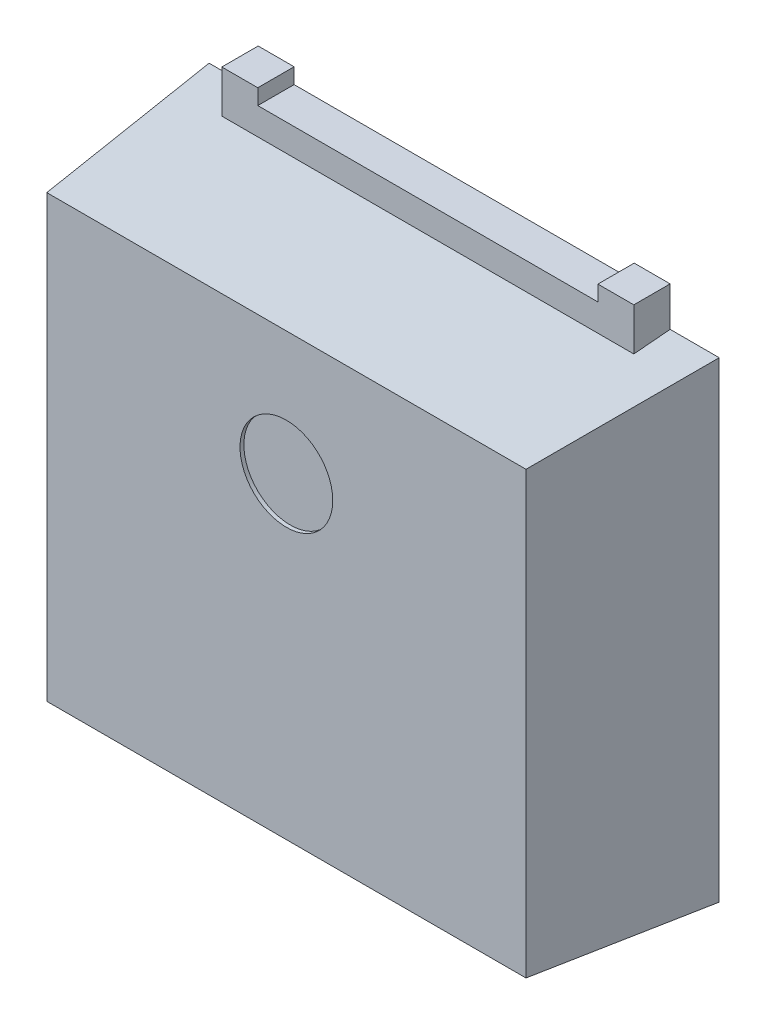
ISO-10303-21;
HEADER;
FILE_DESCRIPTION(('STEP AP214'),'2;1');
FILE_NAME('part.step','',(''),(''),'','','');
FILE_SCHEMA(('AUTOMOTIVE_DESIGN { 1 0 10303 214 1 1 1 1 }'));
ENDSEC;
DATA;
#1=APPLICATION_CONTEXT('core data for automotive mechanical design processes');
#2=APPLICATION_PROTOCOL_DEFINITION('international standard','automotive_design',2000,#1);
#3=PRODUCT_CONTEXT('',#1,'mechanical');
#4=PRODUCT('Part','Part','',(#3));
#5=PRODUCT_RELATED_PRODUCT_CATEGORY('part','',(#4));
#6=PRODUCT_DEFINITION_FORMATION('','',#4);
#7=PRODUCT_DEFINITION_CONTEXT('part definition',#1,'design');
#8=PRODUCT_DEFINITION('design','',#6,#7);
#9=PRODUCT_DEFINITION_SHAPE('','',#8);
#10=(LENGTH_UNIT() NAMED_UNIT(*) SI_UNIT(.MILLI.,.METRE.));
#11=(NAMED_UNIT(*) PLANE_ANGLE_UNIT() SI_UNIT($,.RADIAN.));
#12=(NAMED_UNIT(*) SI_UNIT($,.STERADIAN.) SOLID_ANGLE_UNIT());
#13=UNCERTAINTY_MEASURE_WITH_UNIT(LENGTH_MEASURE(1.E-05),#10,'distance_accuracy_value','');
#14=(GEOMETRIC_REPRESENTATION_CONTEXT(3) GLOBAL_UNCERTAINTY_ASSIGNED_CONTEXT((#13)) GLOBAL_UNIT_ASSIGNED_CONTEXT((#10,
#11,#12)) REPRESENTATION_CONTEXT('',''));
#15=CARTESIAN_POINT('',(0.,0.,0.));
#16=DIRECTION('',(0.,0.,1.));
#17=DIRECTION('',(1.,0.,0.));
#18=AXIS2_PLACEMENT_3D('',#15,#16,#17);
#19=CARTESIAN_POINT('',(0.,0.,0.));
#20=DIRECTION('',(0.,0.,1.));
#21=DIRECTION('',(1.,0.,0.));
#22=AXIS2_PLACEMENT_3D('',#19,#20,#21);
#23=PLANE('',#22);
#24=DIRECTION('',(-1.,0.,0.));
#25=VECTOR('',#24,1.);
#26=CARTESIAN_POINT('',(2.2,3.36,0.));
#27=LINE('',#26,#25);
#28=CARTESIAN_POINT('',(2.2,3.36,0.));
#29=VERTEX_POINT('',#28);
#30=CARTESIAN_POINT('',(-2.2,3.36,0.));
#31=VERTEX_POINT('',#30);
#32=EDGE_CURVE('P0_E153',#29,#31,#27,.T.);
#33=ORIENTED_EDGE('',*,*,#32,.F.);
#34=DIRECTION('',(0.,-1.,0.));
#35=VECTOR('',#34,1.);
#36=CARTESIAN_POINT('',(2.2,3.56,0.));
#37=LINE('',#36,#35);
#38=CARTESIAN_POINT('',(2.2,3.56,0.));
#39=VERTEX_POINT('',#38);
#40=EDGE_CURVE('P0_E26',#39,#29,#37,.T.);
#41=ORIENTED_EDGE('',*,*,#40,.F.);
#42=DIRECTION('',(1.,0.,0.));
#43=VECTOR('',#42,1.);
#44=CARTESIAN_POINT('',(2.2,3.56,0.));
#45=LINE('',#44,#43);
#46=CARTESIAN_POINT('',(2.665,3.56,0.));
#47=VERTEX_POINT('',#46);
#48=EDGE_CURVE('P0_E118',#39,#47,#45,.T.);
#49=ORIENTED_EDGE('',*,*,#48,.T.);
#50=DIRECTION('',(0.,-1.,0.));
#51=VECTOR('',#50,1.);
#52=CARTESIAN_POINT('',(2.665,3.56,0.));
#53=LINE('',#52,#51);
#54=CARTESIAN_POINT('',(2.665,2.698367694,0.));
#55=VERTEX_POINT('',#54);
#56=EDGE_CURVE('P0_E121',#47,#55,#53,.T.);
#57=ORIENTED_EDGE('',*,*,#56,.T.);
#58=DIRECTION('',(-1.,0.,0.));
#59=VECTOR('',#58,1.);
#60=CARTESIAN_POINT('',(2.665,2.698367694,0.));
#61=LINE('',#60,#59);
#62=CARTESIAN_POINT('',(2.177438699,2.698367694,0.));
#63=VERTEX_POINT('',#62);
#64=EDGE_CURVE('P0_E206',#55,#63,#61,.T.);
#65=ORIENTED_EDGE('',*,*,#64,.T.);
#66=DIRECTION('',(0.,-1.,0.));
#67=VECTOR('',#66,1.);
#68=CARTESIAN_POINT('',(2.177438699,2.698367694,0.));
#69=LINE('',#68,#67);
#70=CARTESIAN_POINT('',(2.177438699,2.012696816,0.));
#71=VERTEX_POINT('',#70);
#72=EDGE_CURVE('P0_E258',#63,#71,#69,.T.);
#73=ORIENTED_EDGE('',*,*,#72,.T.);
#74=DIRECTION('',(1.,0.,0.));
#75=VECTOR('',#74,1.);
#76=CARTESIAN_POINT('',(2.177438699,2.012696816,0.));
#77=LINE('',#76,#75);
#78=CARTESIAN_POINT('',(2.665,2.012696816,0.));
#79=VERTEX_POINT('',#78);
#80=EDGE_CURVE('P0_E268',#71,#79,#77,.T.);
#81=ORIENTED_EDGE('',*,*,#80,.T.);
#82=DIRECTION('',(0.,-1.,0.));
#83=VECTOR('',#82,1.);
#84=CARTESIAN_POINT('',(2.665,2.012696816,0.));
#85=LINE('',#84,#83);
#86=CARTESIAN_POINT('',(2.665,-1.84,0.));
#87=VERTEX_POINT('',#86);
#88=EDGE_CURVE('P0_E280',#79,#87,#85,.T.);
#89=ORIENTED_EDGE('',*,*,#88,.T.);
#90=DIRECTION('',(1.,0.,0.));
#91=VECTOR('',#90,1.);
#92=CARTESIAN_POINT('',(-2.665,-1.84,0.));
#93=LINE('',#92,#91);
#94=CARTESIAN_POINT('',(-2.665,-1.84,0.));
#95=VERTEX_POINT('',#94);
#96=EDGE_CURVE('P0_E262',#95,#87,#93,.T.);
#97=ORIENTED_EDGE('',*,*,#96,.F.);
#98=DIRECTION('',(0.,-1.,0.));
#99=VECTOR('',#98,1.);
#100=CARTESIAN_POINT('',(-2.665,2.012696816,0.));
#101=LINE('',#100,#99);
#102=CARTESIAN_POINT('',(-2.665,2.012696816,0.));
#103=VERTEX_POINT('',#102);
#104=EDGE_CURVE('P0_E246',#103,#95,#101,.T.);
#105=ORIENTED_EDGE('',*,*,#104,.F.);
#106=DIRECTION('',(-1.,0.,0.));
#107=VECTOR('',#106,1.);
#108=CARTESIAN_POINT('',(-2.177438699,2.012696816,0.));
#109=LINE('',#108,#107);
#110=CARTESIAN_POINT('',(-2.177438699,2.012696816,0.));
#111=VERTEX_POINT('',#110);
#112=EDGE_CURVE('P0_E234',#111,#103,#109,.T.);
#113=ORIENTED_EDGE('',*,*,#112,.F.);
#114=DIRECTION('',(0.,-1.,0.));
#115=VECTOR('',#114,1.);
#116=CARTESIAN_POINT('',(-2.177438699,2.698367694,0.));
#117=LINE('',#116,#115);
#118=CARTESIAN_POINT('',(-2.177438699,2.698367694,0.));
#119=VERTEX_POINT('',#118);
#120=EDGE_CURVE('P0_E181',#119,#111,#117,.T.);
#121=ORIENTED_EDGE('',*,*,#120,.F.);
#122=DIRECTION('',(1.,0.,0.));
#123=VECTOR('',#122,1.);
#124=CARTESIAN_POINT('',(-2.665,2.698367694,0.));
#125=LINE('',#124,#123);
#126=CARTESIAN_POINT('',(-2.665,2.698367694,0.));
#127=VERTEX_POINT('',#126);
#128=EDGE_CURVE('P0_E173',#127,#119,#125,.T.);
#129=ORIENTED_EDGE('',*,*,#128,.F.);
#130=DIRECTION('',(0.,-1.,0.));
#131=VECTOR('',#130,1.);
#132=CARTESIAN_POINT('',(-2.665,3.56,0.));
#133=LINE('',#132,#131);
#134=CARTESIAN_POINT('',(-2.665,3.56,0.));
#135=VERTEX_POINT('',#134);
#136=EDGE_CURVE('P0_E213',#135,#127,#133,.T.);
#137=ORIENTED_EDGE('',*,*,#136,.F.);
#138=DIRECTION('',(1.,0.,0.));
#139=VECTOR('',#138,1.);
#140=CARTESIAN_POINT('',(-2.665,3.56,0.));
#141=LINE('',#140,#139);
#142=CARTESIAN_POINT('',(-2.2,3.56,0.));
#143=VERTEX_POINT('',#142);
#144=EDGE_CURVE('P0_E199',#135,#143,#141,.T.);
#145=ORIENTED_EDGE('',*,*,#144,.T.);
#146=DIRECTION('',(0.,1.,0.));
#147=VECTOR('',#146,1.);
#148=CARTESIAN_POINT('',(-2.2,3.36,0.));
#149=LINE('',#148,#147);
#150=EDGE_CURVE('P0_E156',#31,#143,#149,.T.);
#151=ORIENTED_EDGE('',*,*,#150,.F.);
#152=EDGE_LOOP('',(#33,#41,#49,#57,#65,#73,#81,#89,#97,#105,#113,#121,#129,#137,#145,#151));
#153=FACE_BOUND('',#152,.T.);
#154=ADVANCED_FACE('P0_F17',(#153),#23,.F.);
#155=CARTESIAN_POINT('',(0.,0.,0.47));
#156=DIRECTION('',(0.,0.,1.));
#157=DIRECTION('',(1.,0.,0.));
#158=AXIS2_PLACEMENT_3D('',#155,#156,#157);
#159=PLANE('',#158);
#160=DIRECTION('',(-1.,0.,0.));
#161=VECTOR('',#160,1.);
#162=CARTESIAN_POINT('',(2.2,3.36,0.47));
#163=LINE('',#162,#161);
#164=CARTESIAN_POINT('',(2.2,3.36,0.47));
#165=VERTEX_POINT('',#164);
#166=CARTESIAN_POINT('',(-2.2,3.36,0.47));
#167=VERTEX_POINT('',#166);
#168=EDGE_CURVE('P0_E154',#165,#167,#163,.T.);
#169=ORIENTED_EDGE('',*,*,#168,.T.);
#170=DIRECTION('',(0.,1.,0.));
#171=VECTOR('',#170,1.);
#172=CARTESIAN_POINT('',(-2.2,3.36,0.47));
#173=LINE('',#172,#171);
#174=CARTESIAN_POINT('',(-2.2,3.56,0.47));
#175=VERTEX_POINT('',#174);
#176=EDGE_CURVE('P0_E188',#167,#175,#173,.T.);
#177=ORIENTED_EDGE('',*,*,#176,.T.);
#178=DIRECTION('',(1.,0.,0.));
#179=VECTOR('',#178,1.);
#180=CARTESIAN_POINT('',(-2.665,3.56,0.47));
#181=LINE('',#180,#179);
#182=CARTESIAN_POINT('',(-2.665,3.56,0.47));
#183=VERTEX_POINT('',#182);
#184=EDGE_CURVE('P0_E198',#183,#175,#181,.T.);
#185=ORIENTED_EDGE('',*,*,#184,.F.);
#186=DIRECTION('',(0.,-1.,0.));
#187=VECTOR('',#186,1.);
#188=CARTESIAN_POINT('',(-2.665,3.56,0.47));
#189=LINE('',#188,#187);
#190=CARTESIAN_POINT('',(-2.665,2.698367694,0.47));
#191=VERTEX_POINT('',#190);
#192=EDGE_CURVE('P0_E170',#183,#191,#189,.T.);
#193=ORIENTED_EDGE('',*,*,#192,.T.);
#194=DIRECTION('',(1.,0.,0.));
#195=VECTOR('',#194,1.);
#196=CARTESIAN_POINT('',(-2.665,2.698367694,0.47));
#197=LINE('',#196,#195);
#198=CARTESIAN_POINT('',(-2.177438699,2.698367694,0.47));
#199=VERTEX_POINT('',#198);
#200=EDGE_CURVE('P0_E178',#191,#199,#197,.T.);
#201=ORIENTED_EDGE('',*,*,#200,.T.);
#202=DIRECTION('',(0.,-1.,0.));
#203=VECTOR('',#202,1.);
#204=CARTESIAN_POINT('',(-2.177438699,2.698367694,0.47));
#205=LINE('',#204,#203);
#206=CARTESIAN_POINT('',(-2.177438699,2.012696816,0.47));
#207=VERTEX_POINT('',#206);
#208=EDGE_CURVE('P0_E230',#199,#207,#205,.T.);
#209=ORIENTED_EDGE('',*,*,#208,.T.);
#210=DIRECTION('',(-1.,0.,0.));
#211=VECTOR('',#210,1.);
#212=CARTESIAN_POINT('',(-2.177438699,2.012696816,0.47));
#213=LINE('',#212,#211);
#214=CARTESIAN_POINT('',(-2.665,2.012696816,0.47));
#215=VERTEX_POINT('',#214);
#216=EDGE_CURVE('P0_E242',#207,#215,#213,.T.);
#217=ORIENTED_EDGE('',*,*,#216,.T.);
#218=DIRECTION('',(0.,-1.,0.));
#219=VECTOR('',#218,1.);
#220=CARTESIAN_POINT('',(-2.665,2.012696816,0.47));
#221=LINE('',#220,#219);
#222=CARTESIAN_POINT('',(-2.665,-1.84,0.47));
#223=VERTEX_POINT('',#222);
#224=EDGE_CURVE('P0_E254',#215,#223,#221,.T.);
#225=ORIENTED_EDGE('',*,*,#224,.T.);
#226=DIRECTION('',(1.,0.,0.));
#227=VECTOR('',#226,1.);
#228=CARTESIAN_POINT('',(-2.665,-1.84,0.47));
#229=LINE('',#228,#227);
#230=CARTESIAN_POINT('',(2.665,-1.84,0.47));
#231=VERTEX_POINT('',#230);
#232=EDGE_CURVE('P0_E276',#223,#231,#229,.T.);
#233=ORIENTED_EDGE('',*,*,#232,.T.);
#234=DIRECTION('',(0.,-1.,0.));
#235=VECTOR('',#234,1.);
#236=CARTESIAN_POINT('',(2.665,2.012696816,0.47));
#237=LINE('',#236,#235);
#238=CARTESIAN_POINT('',(2.665,2.012696816,0.47));
#239=VERTEX_POINT('',#238);
#240=EDGE_CURVE('P0_E287',#239,#231,#237,.T.);
#241=ORIENTED_EDGE('',*,*,#240,.F.);
#242=DIRECTION('',(1.,0.,0.));
#243=VECTOR('',#242,1.);
#244=CARTESIAN_POINT('',(2.177438699,2.012696816,0.47));
#245=LINE('',#244,#243);
#246=CARTESIAN_POINT('',(2.177438699,2.012696816,0.47));
#247=VERTEX_POINT('',#246);
#248=EDGE_CURVE('P0_E267',#247,#239,#245,.T.);
#249=ORIENTED_EDGE('',*,*,#248,.F.);
#250=DIRECTION('',(0.,-1.,0.));
#251=VECTOR('',#250,1.);
#252=CARTESIAN_POINT('',(2.177438699,2.698367694,0.47));
#253=LINE('',#252,#251);
#254=CARTESIAN_POINT('',(2.177438699,2.698367694,0.47));
#255=VERTEX_POINT('',#254);
#256=EDGE_CURVE('P0_E203',#255,#247,#253,.T.);
#257=ORIENTED_EDGE('',*,*,#256,.F.);
#258=DIRECTION('',(-1.,0.,0.));
#259=VECTOR('',#258,1.);
#260=CARTESIAN_POINT('',(2.665,2.698367694,0.47));
#261=LINE('',#260,#259);
#262=CARTESIAN_POINT('',(2.665,2.698367694,0.47));
#263=VERTEX_POINT('',#262);
#264=EDGE_CURVE('P0_E113',#263,#255,#261,.T.);
#265=ORIENTED_EDGE('',*,*,#264,.F.);
#266=DIRECTION('',(0.,-1.,0.));
#267=VECTOR('',#266,1.);
#268=CARTESIAN_POINT('',(2.665,3.56,0.47));
#269=LINE('',#268,#267);
#270=CARTESIAN_POINT('',(2.665,3.56,0.47));
#271=VERTEX_POINT('',#270);
#272=EDGE_CURVE('P0_E109',#271,#263,#269,.T.);
#273=ORIENTED_EDGE('',*,*,#272,.F.);
#274=DIRECTION('',(1.,0.,0.));
#275=VECTOR('',#274,1.);
#276=CARTESIAN_POINT('',(2.2,3.56,0.47));
#277=LINE('',#276,#275);
#278=CARTESIAN_POINT('',(2.2,3.56,0.47));
#279=VERTEX_POINT('',#278);
#280=EDGE_CURVE('P0_E97',#279,#271,#277,.T.);
#281=ORIENTED_EDGE('',*,*,#280,.F.);
#282=DIRECTION('',(0.,-1.,0.));
#283=VECTOR('',#282,1.);
#284=CARTESIAN_POINT('',(2.2,3.56,0.47));
#285=LINE('',#284,#283);
#286=EDGE_CURVE('P0_E11',#279,#165,#285,.T.);
#287=ORIENTED_EDGE('',*,*,#286,.T.);
#288=EDGE_LOOP('',(#169,#177,#185,#193,#201,#209,#217,#225,#233,#241,#249,#257,#265,#273,#281,#287));
#289=FACE_BOUND('',#288,.T.);
#290=ADVANCED_FACE('P0_F111',(#289),#159,.T.);
#291=CARTESIAN_POINT('',(2.2,3.56,0.47));
#292=DIRECTION('',(1.,0.,0.));
#293=DIRECTION('',(0.,1.,0.));
#294=AXIS2_PLACEMENT_3D('',#291,#292,#293);
#295=PLANE('',#294);
#296=ORIENTED_EDGE('',*,*,#40,.T.);
#297=DIRECTION('',(0.,0.,-1.));
#298=VECTOR('',#297,1.);
#299=CARTESIAN_POINT('',(2.2,3.36,0.47));
#300=LINE('',#299,#298);
#301=EDGE_CURVE('P0_E142',#165,#29,#300,.T.);
#302=ORIENTED_EDGE('',*,*,#301,.F.);
#303=ORIENTED_EDGE('',*,*,#286,.F.);
#304=DIRECTION('',(0.,0.,-1.));
#305=VECTOR('',#304,1.);
#306=CARTESIAN_POINT('',(2.2,3.56,0.47));
#307=LINE('',#306,#305);
#308=EDGE_CURVE('P0_E104',#279,#39,#307,.T.);
#309=ORIENTED_EDGE('',*,*,#308,.T.);
#310=EDGE_LOOP('',(#296,#302,#303,#309));
#311=FACE_BOUND('',#310,.T.);
#312=ADVANCED_FACE('P0_F140',(#311),#295,.F.);
#313=CARTESIAN_POINT('',(2.4325,3.56,0.47));
#314=DIRECTION('',(0.,1.,0.));
#315=DIRECTION('',(1.,0.,0.));
#316=AXIS2_PLACEMENT_3D('',#313,#314,#315);
#317=PLANE('',#316);
#318=ORIENTED_EDGE('',*,*,#48,.F.);
#319=ORIENTED_EDGE('',*,*,#308,.F.);
#320=ORIENTED_EDGE('',*,*,#280,.T.);
#321=DIRECTION('',(0.,0.,-1.));
#322=VECTOR('',#321,1.);
#323=CARTESIAN_POINT('',(2.665,3.56,0.47));
#324=LINE('',#323,#322);
#325=EDGE_CURVE('P0_E102',#271,#47,#324,.T.);
#326=ORIENTED_EDGE('',*,*,#325,.T.);
#327=EDGE_LOOP('',(#318,#319,#320,#326));
#328=FACE_BOUND('',#327,.T.);
#329=ADVANCED_FACE('P0_F100',(#328),#317,.T.);
#330=CARTESIAN_POINT('',(2.665,3.05,0.47));
#331=DIRECTION('',(1.,0.,0.));
#332=DIRECTION('',(0.,1.,0.));
#333=AXIS2_PLACEMENT_3D('',#330,#331,#332);
#334=PLANE('',#333);
#335=ORIENTED_EDGE('',*,*,#56,.F.);
#336=ORIENTED_EDGE('',*,*,#325,.F.);
#337=ORIENTED_EDGE('',*,*,#272,.T.);
#338=DIRECTION('',(0.,0.,-1.));
#339=VECTOR('',#338,1.);
#340=CARTESIAN_POINT('',(2.665,2.698367694,0.47));
#341=LINE('',#340,#339);
#342=EDGE_CURVE('P0_E288',#263,#55,#341,.T.);
#343=ORIENTED_EDGE('',*,*,#342,.T.);
#344=EDGE_LOOP('',(#335,#336,#337,#343));
#345=FACE_BOUND('',#344,.T.);
#346=ADVANCED_FACE('P0_F120',(#345),#334,.T.);
#347=CARTESIAN_POINT('',(2.421219349,2.698367694,0.47));
#348=DIRECTION('',(0.,-1.,0.));
#349=DIRECTION('',(0.,0.,-1.));
#350=AXIS2_PLACEMENT_3D('',#347,#348,#349);
#351=PLANE('',#350);
#352=ORIENTED_EDGE('',*,*,#64,.F.);
#353=ORIENTED_EDGE('',*,*,#342,.F.);
#354=ORIENTED_EDGE('',*,*,#264,.T.);
#355=DIRECTION('',(0.,0.,-1.));
#356=VECTOR('',#355,1.);
#357=CARTESIAN_POINT('',(2.177438699,2.698367694,0.47));
#358=LINE('',#357,#356);
#359=EDGE_CURVE('P0_E207',#255,#63,#358,.T.);
#360=ORIENTED_EDGE('',*,*,#359,.T.);
#361=EDGE_LOOP('',(#352,#353,#354,#360));
#362=FACE_BOUND('',#361,.T.);
#363=ADVANCED_FACE('P0_F305',(#362),#351,.T.);
#364=CARTESIAN_POINT('',(2.177438699,2.355532255,0.47));
#365=DIRECTION('',(1.,0.,0.));
#366=DIRECTION('',(0.,1.,0.));
#367=AXIS2_PLACEMENT_3D('',#364,#365,#366);
#368=PLANE('',#367);
#369=ORIENTED_EDGE('',*,*,#72,.F.);
#370=ORIENTED_EDGE('',*,*,#359,.F.);
#371=ORIENTED_EDGE('',*,*,#256,.T.);
#372=DIRECTION('',(0.,0.,-1.));
#373=VECTOR('',#372,1.);
#374=CARTESIAN_POINT('',(2.177438699,2.012696816,0.47));
#375=LINE('',#374,#373);
#376=EDGE_CURVE('P0_E263',#247,#71,#375,.T.);
#377=ORIENTED_EDGE('',*,*,#376,.T.);
#378=EDGE_LOOP('',(#369,#370,#371,#377));
#379=FACE_BOUND('',#378,.T.);
#380=ADVANCED_FACE('P0_F312',(#379),#368,.T.);
#381=CARTESIAN_POINT('',(2.421219349,2.012696816,0.47));
#382=DIRECTION('',(0.,1.,0.));
#383=DIRECTION('',(1.,0.,0.));
#384=AXIS2_PLACEMENT_3D('',#381,#382,#383);
#385=PLANE('',#384);
#386=ORIENTED_EDGE('',*,*,#80,.F.);
#387=ORIENTED_EDGE('',*,*,#376,.F.);
#388=ORIENTED_EDGE('',*,*,#248,.T.);
#389=DIRECTION('',(0.,0.,-1.));
#390=VECTOR('',#389,1.);
#391=CARTESIAN_POINT('',(2.665,2.012696816,0.47));
#392=LINE('',#391,#390);
#393=EDGE_CURVE('P0_E283',#239,#79,#392,.T.);
#394=ORIENTED_EDGE('',*,*,#393,.T.);
#395=EDGE_LOOP('',(#386,#387,#388,#394));
#396=FACE_BOUND('',#395,.T.);
#397=ADVANCED_FACE('P0_F318',(#396),#385,.T.);
#398=CARTESIAN_POINT('',(2.665,0.86,0.47));
#399=DIRECTION('',(1.,0.,0.));
#400=DIRECTION('',(0.,1.,0.));
#401=AXIS2_PLACEMENT_3D('',#398,#399,#400);
#402=PLANE('',#401);
#403=ORIENTED_EDGE('',*,*,#88,.F.);
#404=ORIENTED_EDGE('',*,*,#393,.F.);
#405=ORIENTED_EDGE('',*,*,#240,.T.);
#406=DIRECTION('',(0.,0.,-1.));
#407=VECTOR('',#406,1.);
#408=CARTESIAN_POINT('',(2.665,-1.84,0.47));
#409=LINE('',#408,#407);
#410=EDGE_CURVE('P0_E272',#231,#87,#409,.T.);
#411=ORIENTED_EDGE('',*,*,#410,.T.);
#412=EDGE_LOOP('',(#403,#404,#405,#411));
#413=FACE_BOUND('',#412,.T.);
#414=ADVANCED_FACE('P0_F320',(#413),#402,.T.);
#415=CARTESIAN_POINT('',(0.,-1.84,0.47));
#416=DIRECTION('',(0.,1.,0.));
#417=DIRECTION('',(1.,0.,0.));
#418=AXIS2_PLACEMENT_3D('',#415,#416,#417);
#419=PLANE('',#418);
#420=ORIENTED_EDGE('',*,*,#96,.T.);
#421=ORIENTED_EDGE('',*,*,#410,.F.);
#422=ORIENTED_EDGE('',*,*,#232,.F.);
#423=DIRECTION('',(0.,0.,-1.));
#424=VECTOR('',#423,1.);
#425=CARTESIAN_POINT('',(-2.665,-1.84,0.47));
#426=LINE('',#425,#424);
#427=EDGE_CURVE('P0_E250',#223,#95,#426,.T.);
#428=ORIENTED_EDGE('',*,*,#427,.T.);
#429=EDGE_LOOP('',(#420,#421,#422,#428));
#430=FACE_BOUND('',#429,.T.);
#431=ADVANCED_FACE('P0_F323',(#430),#419,.F.);
#432=CARTESIAN_POINT('',(-2.665,0.086348408,0.47));
#433=DIRECTION('',(1.,0.,0.));
#434=DIRECTION('',(0.,1.,0.));
#435=AXIS2_PLACEMENT_3D('',#432,#433,#434);
#436=PLANE('',#435);
#437=ORIENTED_EDGE('',*,*,#104,.T.);
#438=ORIENTED_EDGE('',*,*,#427,.F.);
#439=ORIENTED_EDGE('',*,*,#224,.F.);
#440=DIRECTION('',(0.,0.,-1.));
#441=VECTOR('',#440,1.);
#442=CARTESIAN_POINT('',(-2.665,2.012696816,0.47));
#443=LINE('',#442,#441);
#444=EDGE_CURVE('P0_E238',#215,#103,#443,.T.);
#445=ORIENTED_EDGE('',*,*,#444,.T.);
#446=EDGE_LOOP('',(#437,#438,#439,#445));
#447=FACE_BOUND('',#446,.T.);
#448=ADVANCED_FACE('P0_F469',(#447),#436,.F.);
#449=CARTESIAN_POINT('',(-2.421219349,2.012696816,0.47));
#450=DIRECTION('',(0.,-1.,0.));
#451=DIRECTION('',(0.,0.,-1.));
#452=AXIS2_PLACEMENT_3D('',#449,#450,#451);
#453=PLANE('',#452);
#454=ORIENTED_EDGE('',*,*,#112,.T.);
#455=ORIENTED_EDGE('',*,*,#444,.F.);
#456=ORIENTED_EDGE('',*,*,#216,.F.);
#457=DIRECTION('',(0.,0.,-1.));
#458=VECTOR('',#457,1.);
#459=CARTESIAN_POINT('',(-2.177438699,2.012696816,0.47));
#460=LINE('',#459,#458);
#461=EDGE_CURVE('P0_E225',#207,#111,#460,.T.);
#462=ORIENTED_EDGE('',*,*,#461,.T.);
#463=EDGE_LOOP('',(#454,#455,#456,#462));
#464=FACE_BOUND('',#463,.T.);
#465=ADVANCED_FACE('P0_F380',(#464),#453,.F.);
#466=CARTESIAN_POINT('',(-2.177438699,2.355532255,0.47));
#467=DIRECTION('',(1.,0.,0.));
#468=DIRECTION('',(0.,1.,0.));
#469=AXIS2_PLACEMENT_3D('',#466,#467,#468);
#470=PLANE('',#469);
#471=ORIENTED_EDGE('',*,*,#120,.T.);
#472=ORIENTED_EDGE('',*,*,#461,.F.);
#473=ORIENTED_EDGE('',*,*,#208,.F.);
#474=DIRECTION('',(0.,0.,-1.));
#475=VECTOR('',#474,1.);
#476=CARTESIAN_POINT('',(-2.177438699,2.698367694,0.47));
#477=LINE('',#476,#475);
#478=EDGE_CURVE('P0_E182',#199,#119,#477,.T.);
#479=ORIENTED_EDGE('',*,*,#478,.T.);
#480=EDGE_LOOP('',(#471,#472,#473,#479));
#481=FACE_BOUND('',#480,.T.);
#482=ADVANCED_FACE('P0_F385',(#481),#470,.F.);
#483=CARTESIAN_POINT('',(-2.421219349,2.698367694,0.47));
#484=DIRECTION('',(0.,1.,0.));
#485=DIRECTION('',(1.,0.,0.));
#486=AXIS2_PLACEMENT_3D('',#483,#484,#485);
#487=PLANE('',#486);
#488=ORIENTED_EDGE('',*,*,#128,.T.);
#489=ORIENTED_EDGE('',*,*,#478,.F.);
#490=ORIENTED_EDGE('',*,*,#200,.F.);
#491=DIRECTION('',(0.,0.,-1.));
#492=VECTOR('',#491,1.);
#493=CARTESIAN_POINT('',(-2.665,2.698367694,0.47));
#494=LINE('',#493,#492);
#495=EDGE_CURVE('P0_E174',#191,#127,#494,.T.);
#496=ORIENTED_EDGE('',*,*,#495,.T.);
#497=EDGE_LOOP('',(#488,#489,#490,#496));
#498=FACE_BOUND('',#497,.T.);
#499=ADVANCED_FACE('P0_F388',(#498),#487,.F.);
#500=CARTESIAN_POINT('',(-2.665,3.129183847,0.47));
#501=DIRECTION('',(1.,0.,0.));
#502=DIRECTION('',(0.,1.,0.));
#503=AXIS2_PLACEMENT_3D('',#500,#501,#502);
#504=PLANE('',#503);
#505=ORIENTED_EDGE('',*,*,#136,.T.);
#506=ORIENTED_EDGE('',*,*,#495,.F.);
#507=ORIENTED_EDGE('',*,*,#192,.F.);
#508=DIRECTION('',(0.,0.,-1.));
#509=VECTOR('',#508,1.);
#510=CARTESIAN_POINT('',(-2.665,3.56,0.47));
#511=LINE('',#510,#509);
#512=EDGE_CURVE('P0_E194',#183,#135,#511,.T.);
#513=ORIENTED_EDGE('',*,*,#512,.T.);
#514=EDGE_LOOP('',(#505,#506,#507,#513));
#515=FACE_BOUND('',#514,.T.);
#516=ADVANCED_FACE('P0_F390',(#515),#504,.F.);
#517=CARTESIAN_POINT('',(-2.4325,3.56,0.47));
#518=DIRECTION('',(0.,1.,0.));
#519=DIRECTION('',(1.,0.,0.));
#520=AXIS2_PLACEMENT_3D('',#517,#518,#519);
#521=PLANE('',#520);
#522=ORIENTED_EDGE('',*,*,#144,.F.);
#523=ORIENTED_EDGE('',*,*,#512,.F.);
#524=ORIENTED_EDGE('',*,*,#184,.T.);
#525=DIRECTION('',(0.,0.,-1.));
#526=VECTOR('',#525,1.);
#527=CARTESIAN_POINT('',(-2.2,3.56,0.47));
#528=LINE('',#527,#526);
#529=EDGE_CURVE('P0_E184',#175,#143,#528,.T.);
#530=ORIENTED_EDGE('',*,*,#529,.T.);
#531=EDGE_LOOP('',(#522,#523,#524,#530));
#532=FACE_BOUND('',#531,.T.);
#533=ADVANCED_FACE('P0_F395',(#532),#521,.T.);
#534=CARTESIAN_POINT('',(-2.2,3.46,0.47));
#535=DIRECTION('',(-1.,0.,0.));
#536=DIRECTION('',(0.,0.,1.));
#537=AXIS2_PLACEMENT_3D('',#534,#535,#536);
#538=PLANE('',#537);
#539=ORIENTED_EDGE('',*,*,#150,.T.);
#540=ORIENTED_EDGE('',*,*,#529,.F.);
#541=ORIENTED_EDGE('',*,*,#176,.F.);
#542=DIRECTION('',(0.,0.,-1.));
#543=VECTOR('',#542,1.);
#544=CARTESIAN_POINT('',(-2.2,3.36,0.47));
#545=LINE('',#544,#543);
#546=EDGE_CURVE('P0_E163',#167,#31,#545,.T.);
#547=ORIENTED_EDGE('',*,*,#546,.T.);
#548=EDGE_LOOP('',(#539,#540,#541,#547));
#549=FACE_BOUND('',#548,.T.);
#550=ADVANCED_FACE('P0_F398',(#549),#538,.F.);
#551=CARTESIAN_POINT('',(0.,3.36,0.47));
#552=DIRECTION('',(0.,-1.,0.));
#553=DIRECTION('',(0.,0.,-1.));
#554=AXIS2_PLACEMENT_3D('',#551,#552,#553);
#555=PLANE('',#554);
#556=ORIENTED_EDGE('',*,*,#32,.T.);
#557=ORIENTED_EDGE('',*,*,#546,.F.);
#558=ORIENTED_EDGE('',*,*,#168,.F.);
#559=ORIENTED_EDGE('',*,*,#301,.T.);
#560=EDGE_LOOP('',(#556,#557,#558,#559));
#561=FACE_BOUND('',#560,.T.);
#562=ADVANCED_FACE('P0_F151',(#561),#555,.F.);
#563=CLOSED_SHELL('',(#154,#290,#312,#329,#346,#363,#380,#397,#414,#431,#448,#465,#482,#499,
#516,#533,#550,#562));
#564=MANIFOLD_SOLID_BREP('P0_B1',#563);
#565=CARTESIAN_POINT('',(0.,0.,2.25));
#566=DIRECTION('',(0.,0.,1.));
#567=DIRECTION('',(1.,0.,0.));
#568=AXIS2_PLACEMENT_3D('',#565,#566,#567);
#569=PLANE('',#568);
#570=CARTESIAN_POINT('',(0.,1.25,2.25));
#571=DIRECTION('',(0.,0.,1.));
#572=DIRECTION('',(1.,0.,0.));
#573=AXIS2_PLACEMENT_3D('',#570,#571,#572);
#574=CIRCLE('',#573,0.6);
#575=CARTESIAN_POINT('',(0.6,1.25,2.25));
#576=VERTEX_POINT('',#575);
#577=EDGE_CURVE('P1_E11',#576,#576,#574,.T.);
#578=ORIENTED_EDGE('',*,*,#577,.T.);
#579=EDGE_LOOP('',(#578));
#580=FACE_BOUND('',#579,.T.);
#581=ADVANCED_FACE('P1_F17',(#580),#569,.T.);
#582=CARTESIAN_POINT('',(0.,1.25,2.27));
#583=DIRECTION('',(0.,0.,1.));
#584=DIRECTION('',(1.,0.,0.));
#585=AXIS2_PLACEMENT_3D('',#582,#583,#584);
#586=CYLINDRICAL_SURFACE('',#585,0.6);
#587=DIRECTION('',(0.,0.,-1.));
#588=VECTOR('',#587,1.);
#589=CARTESIAN_POINT('',(0.6,1.25,2.3));
#590=LINE('',#589,#588);
#591=CARTESIAN_POINT('',(0.6,1.25,2.3));
#592=VERTEX_POINT('',#591);
#593=EDGE_CURVE('P1_E20',#592,#576,#590,.T.);
#594=ORIENTED_EDGE('',*,*,#593,.F.);
#595=CARTESIAN_POINT('',(0.,1.25,2.3));
#596=DIRECTION('',(0.,0.,1.));
#597=DIRECTION('',(1.,0.,0.));
#598=AXIS2_PLACEMENT_3D('',#595,#596,#597);
#599=CIRCLE('',#598,0.6);
#600=EDGE_CURVE('P1_E493',#592,#592,#599,.T.);
#601=ORIENTED_EDGE('',*,*,#600,.T.);
#602=ORIENTED_EDGE('',*,*,#593,.T.);
#603=ORIENTED_EDGE('',*,*,#577,.F.);
#604=EDGE_LOOP('',(#594,#601,#602,#603));
#605=FACE_BOUND('',#604,.T.);
#606=ADVANCED_FACE('P1_F662',(#605),#586,.F.);
#607=CARTESIAN_POINT('',(-15.5,2.95,1.15));
#608=DIRECTION('',(0.,0.996240588225704,0.0866296160196042));
#609=DIRECTION('',(1.,0.,0.));
#610=AXIS2_PLACEMENT_3D('',#607,#608,#609);
#611=PLANE('',#610);
#612=DIRECTION('',(1.,0.,0.));
#613=VECTOR('',#612,1.);
#614=CARTESIAN_POINT('',(-3.3,3.05,0.));
#615=LINE('',#614,#613);
#616=CARTESIAN_POINT('',(-3.3,3.05,0.));
#617=VERTEX_POINT('',#616);
#618=CARTESIAN_POINT('',(-2.665,3.05,0.));
#619=VERTEX_POINT('',#618);
#620=EDGE_CURVE('P1_E312',#617,#619,#615,.T.);
#621=ORIENTED_EDGE('',*,*,#620,.F.);
#622=DIRECTION('',(-0.0863063699721478,0.0863063699721478,-0.992523259679319));
#623=VECTOR('',#622,1.);
#624=CARTESIAN_POINT('',(-3.1,2.85,2.3));
#625=LINE('',#624,#623);
#626=CARTESIAN_POINT('',(-3.1,2.85,2.3));
#627=VERTEX_POINT('',#626);
#628=EDGE_CURVE('P1_E293',#627,#617,#625,.T.);
#629=ORIENTED_EDGE('',*,*,#628,.F.);
#630=DIRECTION('',(1.,0.,0.));
#631=VECTOR('',#630,1.);
#632=CARTESIAN_POINT('',(-3.1,2.85,2.3));
#633=LINE('',#632,#631);
#634=CARTESIAN_POINT('',(3.1,2.85,2.3));
#635=VERTEX_POINT('',#634);
#636=EDGE_CURVE('P1_E488',#627,#635,#633,.T.);
#637=ORIENTED_EDGE('',*,*,#636,.T.);
#638=DIRECTION('',(0.0863063699721478,0.0863063699721478,-0.992523259679319));
#639=VECTOR('',#638,1.);
#640=CARTESIAN_POINT('',(3.1,2.85,2.3));
#641=LINE('',#640,#639);
#642=CARTESIAN_POINT('',(3.3,3.05,0.));
#643=VERTEX_POINT('',#642);
#644=EDGE_CURVE('P1_E283',#635,#643,#641,.T.);
#645=ORIENTED_EDGE('',*,*,#644,.T.);
#646=DIRECTION('',(1.,0.,0.));
#647=VECTOR('',#646,1.);
#648=CARTESIAN_POINT('',(2.665,3.05,0.));
#649=LINE('',#648,#647);
#650=CARTESIAN_POINT('',(2.665,3.05,0.));
#651=VERTEX_POINT('',#650);
#652=EDGE_CURVE('P1_E304',#651,#643,#649,.T.);
#653=ORIENTED_EDGE('',*,*,#652,.F.);
#654=DIRECTION('',(0.,-0.0866296160196042,0.996240588225704));
#655=VECTOR('',#654,1.);
#656=CARTESIAN_POINT('',(2.665,3.05,0.));
#657=LINE('',#656,#655);
#658=CARTESIAN_POINT('',(2.665,3.009130435,0.47));
#659=VERTEX_POINT('',#658);
#660=EDGE_CURVE('P1_E182',#651,#659,#657,.T.);
#661=ORIENTED_EDGE('',*,*,#660,.T.);
#662=DIRECTION('',(-1.,0.,0.));
#663=VECTOR('',#662,1.);
#664=CARTESIAN_POINT('',(2.665,3.009130435,0.47));
#665=LINE('',#664,#663);
#666=CARTESIAN_POINT('',(-2.665,3.009130435,0.47));
#667=VERTEX_POINT('',#666);
#668=EDGE_CURVE('P1_E175',#659,#667,#665,.T.);
#669=ORIENTED_EDGE('',*,*,#668,.T.);
#670=DIRECTION('',(0.,-0.0866296160196042,0.996240588225704));
#671=VECTOR('',#670,1.);
#672=CARTESIAN_POINT('',(-2.665,3.05,0.));
#673=LINE('',#672,#671);
#674=EDGE_CURVE('P1_E179',#619,#667,#673,.T.);
#675=ORIENTED_EDGE('',*,*,#674,.F.);
#676=EDGE_LOOP('',(#621,#629,#637,#645,#653,#661,#669,#675));
#677=FACE_BOUND('',#676,.T.);
#678=ADVANCED_FACE('P1_F177',(#677),#611,.T.);
#679=CARTESIAN_POINT('',(-15.5,-2.95,1.15));
#680=DIRECTION('',(0.,0.996240588225704,-0.0866296160196042));
#681=DIRECTION('',(-1.,0.,0.));
#682=AXIS2_PLACEMENT_3D('',#679,#680,#681);
#683=PLANE('',#682);
#684=DIRECTION('',(1.,0.,0.));
#685=VECTOR('',#684,1.);
#686=CARTESIAN_POINT('',(-3.1,-2.85,2.3));
#687=LINE('',#686,#685);
#688=CARTESIAN_POINT('',(-3.1,-2.85,2.3));
#689=VERTEX_POINT('',#688);
#690=CARTESIAN_POINT('',(3.1,-2.85,2.3));
#691=VERTEX_POINT('',#690);
#692=EDGE_CURVE('P1_E217',#689,#691,#687,.T.);
#693=ORIENTED_EDGE('',*,*,#692,.F.);
#694=DIRECTION('',(-0.0863063699721478,-0.0863063699721478,-0.992523259679319));
#695=VECTOR('',#694,1.);
#696=CARTESIAN_POINT('',(-3.1,-2.85,2.3));
#697=LINE('',#696,#695);
#698=CARTESIAN_POINT('',(-3.3,-3.05,0.));
#699=VERTEX_POINT('',#698);
#700=EDGE_CURVE('P1_E292',#689,#699,#697,.T.);
#701=ORIENTED_EDGE('',*,*,#700,.T.);
#702=DIRECTION('',(-1.,0.,0.));
#703=VECTOR('',#702,1.);
#704=CARTESIAN_POINT('',(3.3,-3.05,0.));
#705=LINE('',#704,#703);
#706=CARTESIAN_POINT('',(3.3,-3.05,0.));
#707=VERTEX_POINT('',#706);
#708=EDGE_CURVE('P1_E307',#707,#699,#705,.T.);
#709=ORIENTED_EDGE('',*,*,#708,.F.);
#710=DIRECTION('',(0.0863063699721478,-0.0863063699721478,-0.992523259679319));
#711=VECTOR('',#710,1.);
#712=CARTESIAN_POINT('',(3.1,-2.85,2.3));
#713=LINE('',#712,#711);
#714=EDGE_CURVE('P1_E287',#691,#707,#713,.T.);
#715=ORIENTED_EDGE('',*,*,#714,.F.);
#716=EDGE_LOOP('',(#693,#701,#709,#715));
#717=FACE_BOUND('',#716,.T.);
#718=ADVANCED_FACE('P1_F639',(#717),#683,.F.);
#719=CARTESIAN_POINT('',(2.421219349,2.698367694,0.47));
#720=DIRECTION('',(0.,-1.,0.));
#721=DIRECTION('',(0.,0.,-1.));
#722=AXIS2_PLACEMENT_3D('',#719,#720,#721);
#723=PLANE('',#722);
#724=DIRECTION('',(-1.,0.,0.));
#725=VECTOR('',#724,1.);
#726=CARTESIAN_POINT('',(2.665,2.698367694,0.));
#727=LINE('',#726,#725);
#728=CARTESIAN_POINT('',(2.665,2.698367694,0.));
#729=VERTEX_POINT('',#728);
#730=CARTESIAN_POINT('',(2.177438699,2.698367694,0.));
#731=VERTEX_POINT('',#730);
#732=EDGE_CURVE('P1_E338',#729,#731,#727,.T.);
#733=ORIENTED_EDGE('',*,*,#732,.T.);
#734=DIRECTION('',(0.,0.,-1.));
#735=VECTOR('',#734,1.);
#736=CARTESIAN_POINT('',(2.177438699,2.698367694,0.47));
#737=LINE('',#736,#735);
#738=CARTESIAN_POINT('',(2.177438699,2.698367694,0.47));
#739=VERTEX_POINT('',#738);
#740=EDGE_CURVE('P1_E43',#739,#731,#737,.T.);
#741=ORIENTED_EDGE('',*,*,#740,.F.);
#742=DIRECTION('',(-1.,0.,0.));
#743=VECTOR('',#742,1.);
#744=CARTESIAN_POINT('',(2.665,2.698367694,0.47));
#745=LINE('',#744,#743);
#746=CARTESIAN_POINT('',(2.665,2.698367694,0.47));
#747=VERTEX_POINT('',#746);
#748=EDGE_CURVE('P1_E187',#747,#739,#745,.T.);
#749=ORIENTED_EDGE('',*,*,#748,.F.);
#750=DIRECTION('',(0.,0.,-1.));
#751=VECTOR('',#750,1.);
#752=CARTESIAN_POINT('',(2.665,2.698367694,0.47));
#753=LINE('',#752,#751);
#754=EDGE_CURVE('P1_E224',#747,#729,#753,.T.);
#755=ORIENTED_EDGE('',*,*,#754,.T.);
#756=EDGE_LOOP('',(#733,#741,#749,#755));
#757=FACE_BOUND('',#756,.T.);
#758=ADVANCED_FACE('P1_F586',(#757),#723,.F.);
#759=CARTESIAN_POINT('',(2.177438699,2.355532255,0.47));
#760=DIRECTION('',(1.,0.,0.));
#761=DIRECTION('',(0.,1.,0.));
#762=AXIS2_PLACEMENT_3D('',#759,#760,#761);
#763=PLANE('',#762);
#764=DIRECTION('',(0.,-1.,0.));
#765=VECTOR('',#764,1.);
#766=CARTESIAN_POINT('',(2.177438699,2.698367694,0.));
#767=LINE('',#766,#765);
#768=CARTESIAN_POINT('',(2.177438699,2.012696816,0.));
#769=VERTEX_POINT('',#768);
#770=EDGE_CURVE('P1_E335',#731,#769,#767,.T.);
#771=ORIENTED_EDGE('',*,*,#770,.T.);
#772=DIRECTION('',(0.,0.,-1.));
#773=VECTOR('',#772,1.);
#774=CARTESIAN_POINT('',(2.177438699,2.012696816,0.47));
#775=LINE('',#774,#773);
#776=CARTESIAN_POINT('',(2.177438699,2.012696816,0.47));
#777=VERTEX_POINT('',#776);
#778=EDGE_CURVE('P1_E250',#777,#769,#775,.T.);
#779=ORIENTED_EDGE('',*,*,#778,.F.);
#780=DIRECTION('',(0.,-1.,0.));
#781=VECTOR('',#780,1.);
#782=CARTESIAN_POINT('',(2.177438699,2.698367694,0.47));
#783=LINE('',#782,#781);
#784=EDGE_CURVE('P1_E249',#739,#777,#783,.T.);
#785=ORIENTED_EDGE('',*,*,#784,.F.);
#786=ORIENTED_EDGE('',*,*,#740,.T.);
#787=EDGE_LOOP('',(#771,#779,#785,#786));
#788=FACE_BOUND('',#787,.T.);
#789=ADVANCED_FACE('P1_F581',(#788),#763,.F.);
#790=CARTESIAN_POINT('',(2.421219349,2.012696816,0.47));
#791=DIRECTION('',(0.,1.,0.));
#792=DIRECTION('',(1.,0.,0.));
#793=AXIS2_PLACEMENT_3D('',#790,#791,#792);
#794=PLANE('',#793);
#795=DIRECTION('',(1.,0.,0.));
#796=VECTOR('',#795,1.);
#797=CARTESIAN_POINT('',(2.177438699,2.012696816,0.));
#798=LINE('',#797,#796);
#799=CARTESIAN_POINT('',(2.665,2.012696816,0.));
#800=VERTEX_POINT('',#799);
#801=EDGE_CURVE('P1_E245',#769,#800,#798,.T.);
#802=ORIENTED_EDGE('',*,*,#801,.T.);
#803=DIRECTION('',(0.,0.,-1.));
#804=VECTOR('',#803,1.);
#805=CARTESIAN_POINT('',(2.665,2.012696816,0.47));
#806=LINE('',#805,#804);
#807=CARTESIAN_POINT('',(2.665,2.012696816,0.47));
#808=VERTEX_POINT('',#807);
#809=EDGE_CURVE('P1_E253',#808,#800,#806,.T.);
#810=ORIENTED_EDGE('',*,*,#809,.F.);
#811=DIRECTION('',(1.,0.,0.));
#812=VECTOR('',#811,1.);
#813=CARTESIAN_POINT('',(2.177438699,2.012696816,0.47));
#814=LINE('',#813,#812);
#815=EDGE_CURVE('P1_E257',#777,#808,#814,.T.);
#816=ORIENTED_EDGE('',*,*,#815,.F.);
#817=ORIENTED_EDGE('',*,*,#778,.T.);
#818=EDGE_LOOP('',(#802,#810,#816,#817));
#819=FACE_BOUND('',#818,.T.);
#820=ADVANCED_FACE('P1_F357',(#819),#794,.F.);
#821=CARTESIAN_POINT('',(2.665,0.86,0.47));
#822=DIRECTION('',(1.,0.,0.));
#823=DIRECTION('',(0.,1.,0.));
#824=AXIS2_PLACEMENT_3D('',#821,#822,#823);
#825=PLANE('',#824);
#826=DIRECTION('',(0.,-1.,0.));
#827=VECTOR('',#826,1.);
#828=CARTESIAN_POINT('',(2.665,2.012696816,0.));
#829=LINE('',#828,#827);
#830=CARTESIAN_POINT('',(2.665,-1.84,0.));
#831=VERTEX_POINT('',#830);
#832=EDGE_CURVE('P1_E241',#800,#831,#829,.T.);
#833=ORIENTED_EDGE('',*,*,#832,.T.);
#834=DIRECTION('',(0.,0.,-1.));
#835=VECTOR('',#834,1.);
#836=CARTESIAN_POINT('',(2.665,-1.84,0.47));
#837=LINE('',#836,#835);
#838=CARTESIAN_POINT('',(2.665,-1.84,0.47));
#839=VERTEX_POINT('',#838);
#840=EDGE_CURVE('P1_E328',#839,#831,#837,.T.);
#841=ORIENTED_EDGE('',*,*,#840,.F.);
#842=DIRECTION('',(0.,-1.,0.));
#843=VECTOR('',#842,1.);
#844=CARTESIAN_POINT('',(2.665,2.012696816,0.47));
#845=LINE('',#844,#843);
#846=EDGE_CURVE('P1_E261',#808,#839,#845,.T.);
#847=ORIENTED_EDGE('',*,*,#846,.F.);
#848=ORIENTED_EDGE('',*,*,#809,.T.);
#849=EDGE_LOOP('',(#833,#841,#847,#848));
#850=FACE_BOUND('',#849,.T.);
#851=ADVANCED_FACE('P1_F351',(#850),#825,.F.);
#852=CARTESIAN_POINT('',(0.,-1.84,0.47));
#853=DIRECTION('',(0.,1.,0.));
#854=DIRECTION('',(1.,0.,0.));
#855=AXIS2_PLACEMENT_3D('',#852,#853,#854);
#856=PLANE('',#855);
#857=DIRECTION('',(1.,0.,0.));
#858=VECTOR('',#857,1.);
#859=CARTESIAN_POINT('',(-2.665,-1.84,0.));
#860=LINE('',#859,#858);
#861=CARTESIAN_POINT('',(-2.665,-1.84,0.));
#862=VERTEX_POINT('',#861);
#863=EDGE_CURVE('P1_E215',#862,#831,#860,.T.);
#864=ORIENTED_EDGE('',*,*,#863,.F.);
#865=DIRECTION('',(0.,0.,-1.));
#866=VECTOR('',#865,1.);
#867=CARTESIAN_POINT('',(-2.665,-1.84,0.47));
#868=LINE('',#867,#866);
#869=CARTESIAN_POINT('',(-2.665,-1.84,0.47));
#870=VERTEX_POINT('',#869);
#871=EDGE_CURVE('P1_E331',#870,#862,#868,.T.);
#872=ORIENTED_EDGE('',*,*,#871,.F.);
#873=DIRECTION('',(1.,0.,0.));
#874=VECTOR('',#873,1.);
#875=CARTESIAN_POINT('',(-2.665,-1.84,0.47));
#876=LINE('',#875,#874);
#877=EDGE_CURVE('P1_E265',#870,#839,#876,.T.);
#878=ORIENTED_EDGE('',*,*,#877,.T.);
#879=ORIENTED_EDGE('',*,*,#840,.T.);
#880=EDGE_LOOP('',(#864,#872,#878,#879));
#881=FACE_BOUND('',#880,.T.);
#882=ADVANCED_FACE('P1_F617',(#881),#856,.T.);
#883=CARTESIAN_POINT('',(-2.665,0.086348408,0.47));
#884=DIRECTION('',(1.,0.,0.));
#885=DIRECTION('',(0.,1.,0.));
#886=AXIS2_PLACEMENT_3D('',#883,#884,#885);
#887=PLANE('',#886);
#888=DIRECTION('',(0.,-1.,0.));
#889=VECTOR('',#888,1.);
#890=CARTESIAN_POINT('',(-2.665,2.012696816,0.));
#891=LINE('',#890,#889);
#892=CARTESIAN_POINT('',(-2.665,2.012696816,0.));
#893=VERTEX_POINT('',#892);
#894=EDGE_CURVE('P1_E324',#893,#862,#891,.T.);
#895=ORIENTED_EDGE('',*,*,#894,.F.);
#896=DIRECTION('',(0.,0.,-1.));
#897=VECTOR('',#896,1.);
#898=CARTESIAN_POINT('',(-2.665,2.012696816,0.47));
#899=LINE('',#898,#897);
#900=CARTESIAN_POINT('',(-2.665,2.012696816,0.47));
#901=VERTEX_POINT('',#900);
#902=EDGE_CURVE('P1_E236',#901,#893,#899,.T.);
#903=ORIENTED_EDGE('',*,*,#902,.F.);
#904=DIRECTION('',(0.,-1.,0.));
#905=VECTOR('',#904,1.);
#906=CARTESIAN_POINT('',(-2.665,2.012696816,0.47));
#907=LINE('',#906,#905);
#908=EDGE_CURVE('P1_E269',#901,#870,#907,.T.);
#909=ORIENTED_EDGE('',*,*,#908,.T.);
#910=ORIENTED_EDGE('',*,*,#871,.T.);
#911=EDGE_LOOP('',(#895,#903,#909,#910));
#912=FACE_BOUND('',#911,.T.);
#913=ADVANCED_FACE('P1_F541',(#912),#887,.T.);
#914=CARTESIAN_POINT('',(-2.421219349,2.012696816,0.47));
#915=DIRECTION('',(0.,-1.,0.));
#916=DIRECTION('',(0.,0.,-1.));
#917=AXIS2_PLACEMENT_3D('',#914,#915,#916);
#918=PLANE('',#917);
#919=DIRECTION('',(-1.,0.,0.));
#920=VECTOR('',#919,1.);
#921=CARTESIAN_POINT('',(-2.177438699,2.012696816,0.));
#922=LINE('',#921,#920);
#923=CARTESIAN_POINT('',(-2.177438699,2.012696816,0.));
#924=VERTEX_POINT('',#923);
#925=EDGE_CURVE('P1_E317',#924,#893,#922,.T.);
#926=ORIENTED_EDGE('',*,*,#925,.F.);
#927=DIRECTION('',(0.,0.,-1.));
#928=VECTOR('',#927,1.);
#929=CARTESIAN_POINT('',(-2.177438699,2.012696816,0.47));
#930=LINE('',#929,#928);
#931=CARTESIAN_POINT('',(-2.177438699,2.012696816,0.47));
#932=VERTEX_POINT('',#931);
#933=EDGE_CURVE('P1_E233',#932,#924,#930,.T.);
#934=ORIENTED_EDGE('',*,*,#933,.F.);
#935=DIRECTION('',(-1.,0.,0.));
#936=VECTOR('',#935,1.);
#937=CARTESIAN_POINT('',(-2.177438699,2.012696816,0.47));
#938=LINE('',#937,#936);
#939=EDGE_CURVE('P1_E273',#932,#901,#938,.T.);
#940=ORIENTED_EDGE('',*,*,#939,.T.);
#941=ORIENTED_EDGE('',*,*,#902,.T.);
#942=EDGE_LOOP('',(#926,#934,#940,#941));
#943=FACE_BOUND('',#942,.T.);
#944=ADVANCED_FACE('P1_F535',(#943),#918,.T.);
#945=CARTESIAN_POINT('',(-2.177438699,2.355532255,0.47));
#946=DIRECTION('',(1.,0.,0.));
#947=DIRECTION('',(0.,1.,0.));
#948=AXIS2_PLACEMENT_3D('',#945,#946,#947);
#949=PLANE('',#948);
#950=DIRECTION('',(0.,-1.,0.));
#951=VECTOR('',#950,1.);
#952=CARTESIAN_POINT('',(-2.177438699,2.698367694,0.));
#953=LINE('',#952,#951);
#954=CARTESIAN_POINT('',(-2.177438699,2.698367694,0.));
#955=VERTEX_POINT('',#954);
#956=EDGE_CURVE('P1_E313',#955,#924,#953,.T.);
#957=ORIENTED_EDGE('',*,*,#956,.F.);
#958=DIRECTION('',(0.,0.,-1.));
#959=VECTOR('',#958,1.);
#960=CARTESIAN_POINT('',(-2.177438699,2.698367694,0.47));
#961=LINE('',#960,#959);
#962=CARTESIAN_POINT('',(-2.177438699,2.698367694,0.47));
#963=VERTEX_POINT('',#962);
#964=EDGE_CURVE('P1_E237',#963,#955,#961,.T.);
#965=ORIENTED_EDGE('',*,*,#964,.F.);
#966=DIRECTION('',(0.,-1.,0.));
#967=VECTOR('',#966,1.);
#968=CARTESIAN_POINT('',(-2.177438699,2.698367694,0.47));
#969=LINE('',#968,#967);
#970=EDGE_CURVE('P1_E277',#963,#932,#969,.T.);
#971=ORIENTED_EDGE('',*,*,#970,.T.);
#972=ORIENTED_EDGE('',*,*,#933,.T.);
#973=EDGE_LOOP('',(#957,#965,#971,#972));
#974=FACE_BOUND('',#973,.T.);
#975=ADVANCED_FACE('P1_F540',(#974),#949,.T.);
#976=CARTESIAN_POINT('',(-2.421219349,2.698367694,0.47));
#977=DIRECTION('',(0.,1.,0.));
#978=DIRECTION('',(1.,0.,0.));
#979=AXIS2_PLACEMENT_3D('',#976,#977,#978);
#980=PLANE('',#979);
#981=DIRECTION('',(1.,0.,0.));
#982=VECTOR('',#981,1.);
#983=CARTESIAN_POINT('',(-2.665,2.698367694,0.));
#984=LINE('',#983,#982);
#985=CARTESIAN_POINT('',(-2.665,2.698367694,0.));
#986=VERTEX_POINT('',#985);
#987=EDGE_CURVE('P1_E318',#986,#955,#984,.T.);
#988=ORIENTED_EDGE('',*,*,#987,.F.);
#989=DIRECTION('',(0.,0.,-1.));
#990=VECTOR('',#989,1.);
#991=CARTESIAN_POINT('',(-2.665,2.698367694,0.47));
#992=LINE('',#991,#990);
#993=CARTESIAN_POINT('',(-2.665,2.698367694,0.47));
#994=VERTEX_POINT('',#993);
#995=EDGE_CURVE('P1_E200',#994,#986,#992,.T.);
#996=ORIENTED_EDGE('',*,*,#995,.F.);
#997=DIRECTION('',(1.,0.,0.));
#998=VECTOR('',#997,1.);
#999=CARTESIAN_POINT('',(-2.665,2.698367694,0.47));
#1000=LINE('',#999,#998);
#1001=EDGE_CURVE('P1_E195',#994,#963,#1000,.T.);
#1002=ORIENTED_EDGE('',*,*,#1001,.T.);
#1003=ORIENTED_EDGE('',*,*,#964,.T.);
#1004=EDGE_LOOP('',(#988,#996,#1002,#1003));
#1005=FACE_BOUND('',#1004,.T.);
#1006=ADVANCED_FACE('P1_F595',(#1005),#980,.T.);
#1007=CARTESIAN_POINT('',(0.,0.,0.));
#1008=DIRECTION('',(0.,0.,1.));
#1009=DIRECTION('',(1.,0.,0.));
#1010=AXIS2_PLACEMENT_3D('',#1007,#1008,#1009);
#1011=PLANE('',#1010);
#1012=DIRECTION('',(0.,-1.,0.));
#1013=VECTOR('',#1012,1.);
#1014=CARTESIAN_POINT('',(2.665,3.05,0.));
#1015=LINE('',#1014,#1013);
#1016=EDGE_CURVE('P1_E232',#651,#729,#1015,.T.);
#1017=ORIENTED_EDGE('',*,*,#1016,.F.);
#1018=ORIENTED_EDGE('',*,*,#652,.T.);
#1019=DIRECTION('',(0.,-1.,0.));
#1020=VECTOR('',#1019,1.);
#1021=CARTESIAN_POINT('',(3.3,3.05,0.));
#1022=LINE('',#1021,#1020);
#1023=EDGE_CURVE('P1_E294',#643,#707,#1022,.T.);
#1024=ORIENTED_EDGE('',*,*,#1023,.T.);
#1025=ORIENTED_EDGE('',*,*,#708,.T.);
#1026=DIRECTION('',(0.,1.,0.));
#1027=VECTOR('',#1026,1.);
#1028=CARTESIAN_POINT('',(-3.3,-3.05,0.));
#1029=LINE('',#1028,#1027);
#1030=EDGE_CURVE('P1_E288',#699,#617,#1029,.T.);
#1031=ORIENTED_EDGE('',*,*,#1030,.T.);
#1032=ORIENTED_EDGE('',*,*,#620,.T.);
#1033=DIRECTION('',(0.,-1.,0.));
#1034=VECTOR('',#1033,1.);
#1035=CARTESIAN_POINT('',(-2.665,3.05,0.));
#1036=LINE('',#1035,#1034);
#1037=EDGE_CURVE('P1_E204',#619,#986,#1036,.T.);
#1038=ORIENTED_EDGE('',*,*,#1037,.T.);
#1039=ORIENTED_EDGE('',*,*,#987,.T.);
#1040=ORIENTED_EDGE('',*,*,#956,.T.);
#1041=ORIENTED_EDGE('',*,*,#925,.T.);
#1042=ORIENTED_EDGE('',*,*,#894,.T.);
#1043=ORIENTED_EDGE('',*,*,#863,.T.);
#1044=ORIENTED_EDGE('',*,*,#832,.F.);
#1045=ORIENTED_EDGE('',*,*,#801,.F.);
#1046=ORIENTED_EDGE('',*,*,#770,.F.);
#1047=ORIENTED_EDGE('',*,*,#732,.F.);
#1048=EDGE_LOOP('',(#1017,#1018,#1024,#1025,#1031,#1032,#1038,#1039,#1040,#1041,#1042,#1043,
#1044,#1045,#1046,#1047));
#1049=FACE_BOUND('',#1048,.T.);
#1050=ADVANCED_FACE('P1_F361',(#1049),#1011,.F.);
#1051=CARTESIAN_POINT('',(-3.2,5.55,1.15));
#1052=DIRECTION('',(-0.996240588225704,0.,0.0866296160196042));
#1053=DIRECTION('',(0.,1.,0.));
#1054=AXIS2_PLACEMENT_3D('',#1051,#1052,#1053);
#1055=PLANE('',#1054);
#1056=DIRECTION('',(0.,-1.,0.));
#1057=VECTOR('',#1056,1.);
#1058=CARTESIAN_POINT('',(-3.1,2.85,2.3));
#1059=LINE('',#1058,#1057);
#1060=EDGE_CURVE('P1_E221',#627,#689,#1059,.T.);
#1061=ORIENTED_EDGE('',*,*,#1060,.F.);
#1062=ORIENTED_EDGE('',*,*,#628,.T.);
#1063=ORIENTED_EDGE('',*,*,#1030,.F.);
#1064=ORIENTED_EDGE('',*,*,#700,.F.);
#1065=EDGE_LOOP('',(#1061,#1062,#1063,#1064));
#1066=FACE_BOUND('',#1065,.T.);
#1067=ADVANCED_FACE('P1_F561',(#1066),#1055,.T.);
#1068=CARTESIAN_POINT('',(3.2,5.55,1.15));
#1069=DIRECTION('',(-0.996240588225704,0.,-0.0866296160196042));
#1070=DIRECTION('',(-0.0866296160196042,0.,0.996240588225704));
#1071=AXIS2_PLACEMENT_3D('',#1068,#1069,#1070);
#1072=PLANE('',#1071);
#1073=ORIENTED_EDGE('',*,*,#644,.F.);
#1074=DIRECTION('',(0.,-1.,0.));
#1075=VECTOR('',#1074,1.);
#1076=CARTESIAN_POINT('',(3.1,2.85,2.3));
#1077=LINE('',#1076,#1075);
#1078=EDGE_CURVE('P1_E211',#635,#691,#1077,.T.);
#1079=ORIENTED_EDGE('',*,*,#1078,.T.);
#1080=ORIENTED_EDGE('',*,*,#714,.T.);
#1081=ORIENTED_EDGE('',*,*,#1023,.F.);
#1082=EDGE_LOOP('',(#1073,#1079,#1080,#1081));
#1083=FACE_BOUND('',#1082,.T.);
#1084=ADVANCED_FACE('P1_F556',(#1083),#1072,.F.);
#1085=CARTESIAN_POINT('',(0.,0.,0.47));
#1086=DIRECTION('',(0.,0.,1.));
#1087=DIRECTION('',(1.,0.,0.));
#1088=AXIS2_PLACEMENT_3D('',#1085,#1086,#1087);
#1089=PLANE('',#1088);
#1090=ORIENTED_EDGE('',*,*,#668,.F.);
#1091=DIRECTION('',(0.,-1.,0.));
#1092=VECTOR('',#1091,1.);
#1093=CARTESIAN_POINT('',(2.665,3.009130435,0.47));
#1094=LINE('',#1093,#1092);
#1095=EDGE_CURVE('P1_E188',#659,#747,#1094,.T.);
#1096=ORIENTED_EDGE('',*,*,#1095,.T.);
#1097=ORIENTED_EDGE('',*,*,#748,.T.);
#1098=ORIENTED_EDGE('',*,*,#784,.T.);
#1099=ORIENTED_EDGE('',*,*,#815,.T.);
#1100=ORIENTED_EDGE('',*,*,#846,.T.);
#1101=ORIENTED_EDGE('',*,*,#877,.F.);
#1102=ORIENTED_EDGE('',*,*,#908,.F.);
#1103=ORIENTED_EDGE('',*,*,#939,.F.);
#1104=ORIENTED_EDGE('',*,*,#970,.F.);
#1105=ORIENTED_EDGE('',*,*,#1001,.F.);
#1106=DIRECTION('',(0.,-1.,0.));
#1107=VECTOR('',#1106,1.);
#1108=CARTESIAN_POINT('',(-2.665,3.009130435,0.47));
#1109=LINE('',#1108,#1107);
#1110=EDGE_CURVE('P1_E191',#667,#994,#1109,.T.);
#1111=ORIENTED_EDGE('',*,*,#1110,.F.);
#1112=EDGE_LOOP('',(#1090,#1096,#1097,#1098,#1099,#1100,#1101,#1102,#1103,#1104,#1105,#1111));
#1113=FACE_BOUND('',#1112,.T.);
#1114=ADVANCED_FACE('P1_F192',(#1113),#1089,.F.);
#1115=CARTESIAN_POINT('',(2.665,3.05,0.47));
#1116=DIRECTION('',(1.,0.,0.));
#1117=DIRECTION('',(0.,1.,0.));
#1118=AXIS2_PLACEMENT_3D('',#1115,#1116,#1117);
#1119=PLANE('',#1118);
#1120=ORIENTED_EDGE('',*,*,#660,.F.);
#1121=ORIENTED_EDGE('',*,*,#1016,.T.);
#1122=ORIENTED_EDGE('',*,*,#754,.F.);
#1123=ORIENTED_EDGE('',*,*,#1095,.F.);
#1124=EDGE_LOOP('',(#1120,#1121,#1122,#1123));
#1125=FACE_BOUND('',#1124,.T.);
#1126=ADVANCED_FACE('P1_F530',(#1125),#1119,.F.);
#1127=CARTESIAN_POINT('',(-2.665,3.129183847,0.47));
#1128=DIRECTION('',(1.,0.,0.));
#1129=DIRECTION('',(0.,1.,0.));
#1130=AXIS2_PLACEMENT_3D('',#1127,#1128,#1129);
#1131=PLANE('',#1130);
#1132=ORIENTED_EDGE('',*,*,#1037,.F.);
#1133=ORIENTED_EDGE('',*,*,#674,.T.);
#1134=ORIENTED_EDGE('',*,*,#1110,.T.);
#1135=ORIENTED_EDGE('',*,*,#995,.T.);
#1136=EDGE_LOOP('',(#1132,#1133,#1134,#1135));
#1137=FACE_BOUND('',#1136,.T.);
#1138=ADVANCED_FACE('P1_F202',(#1137),#1131,.T.);
#1139=CARTESIAN_POINT('',(0.,0.,2.3));
#1140=DIRECTION('',(0.,0.,1.));
#1141=DIRECTION('',(1.,0.,0.));
#1142=AXIS2_PLACEMENT_3D('',#1139,#1140,#1141);
#1143=PLANE('',#1142);
#1144=ORIENTED_EDGE('',*,*,#636,.F.);
#1145=ORIENTED_EDGE('',*,*,#1060,.T.);
#1146=ORIENTED_EDGE('',*,*,#692,.T.);
#1147=ORIENTED_EDGE('',*,*,#1078,.F.);
#1148=EDGE_LOOP('',(#1144,#1145,#1146,#1147));
#1149=FACE_BOUND('',#1148,.T.);
#1150=ORIENTED_EDGE('',*,*,#600,.F.);
#1151=EDGE_LOOP('',(#1150));
#1152=FACE_BOUND('',#1151,.T.);
#1153=ADVANCED_FACE('P1_F507',(#1149,#1152),#1143,.T.);
#1154=CLOSED_SHELL('',(#581,#606,#678,#718,#758,#789,#820,#851,#882,#913,#944,#975,#1006,#1050,
#1067,#1084,#1114,#1126,#1138,#1153));
#1155=MANIFOLD_SOLID_BREP('P1_B1',#1154);
#1156=ADVANCED_BREP_SHAPE_REPRESENTATION('',(#18,#564,#1155),#14);
#1157=SHAPE_DEFINITION_REPRESENTATION(#9,#1156);
ENDSEC;
END-ISO-10303-21;
